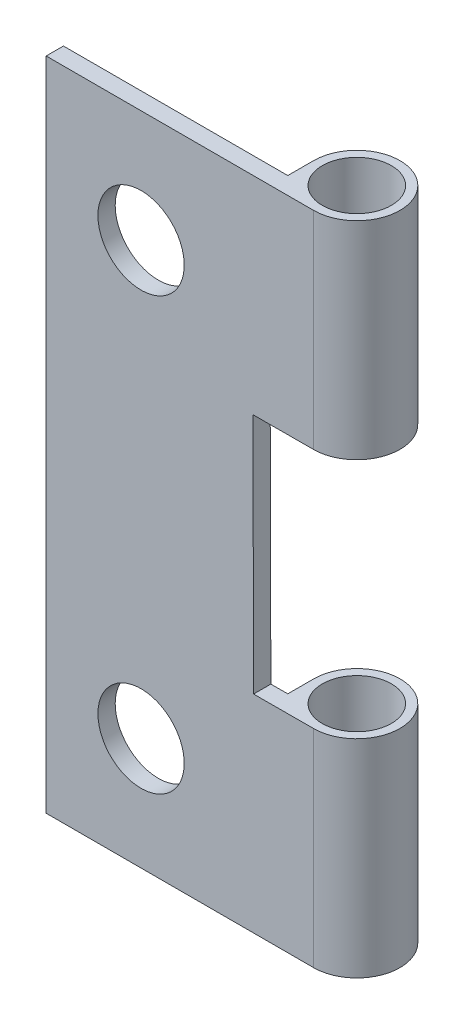
ISO-10303-21;
HEADER;
FILE_DESCRIPTION(('STEP AP214'),'2;1');
FILE_NAME('part.step','',(''),(''),'','','');
FILE_SCHEMA(('AUTOMOTIVE_DESIGN { 1 0 10303 214 1 1 1 1 }'));
ENDSEC;
DATA;
#1=APPLICATION_CONTEXT('core data for automotive mechanical design processes');
#2=APPLICATION_PROTOCOL_DEFINITION('international standard','automotive_design',2000,#1);
#3=PRODUCT_CONTEXT('',#1,'mechanical');
#4=PRODUCT('Part','Part','',(#3));
#5=PRODUCT_RELATED_PRODUCT_CATEGORY('part','',(#4));
#6=PRODUCT_DEFINITION_FORMATION('','',#4);
#7=PRODUCT_DEFINITION_CONTEXT('part definition',#1,'design');
#8=PRODUCT_DEFINITION('design','',#6,#7);
#9=PRODUCT_DEFINITION_SHAPE('','',#8);
#10=(LENGTH_UNIT() NAMED_UNIT(*) SI_UNIT(.MILLI.,.METRE.));
#11=(NAMED_UNIT(*) PLANE_ANGLE_UNIT() SI_UNIT($,.RADIAN.));
#12=(NAMED_UNIT(*) SI_UNIT($,.STERADIAN.) SOLID_ANGLE_UNIT());
#13=UNCERTAINTY_MEASURE_WITH_UNIT(LENGTH_MEASURE(1.E-05),#10,'distance_accuracy_value','');
#14=(GEOMETRIC_REPRESENTATION_CONTEXT(3) GLOBAL_UNCERTAINTY_ASSIGNED_CONTEXT((#13)) GLOBAL_UNIT_ASSIGNED_CONTEXT((#10,
#11,#12)) REPRESENTATION_CONTEXT('',''));
#15=CARTESIAN_POINT('',(0.,0.,0.));
#16=DIRECTION('',(0.,0.,1.));
#17=DIRECTION('',(1.,0.,0.));
#18=AXIS2_PLACEMENT_3D('',#15,#16,#17);
#19=CARTESIAN_POINT('',(6.5,-19.,1.));
#20=DIRECTION('',(-1.,0.,0.));
#21=DIRECTION('',(0.,0.,1.));
#22=AXIS2_PLACEMENT_3D('',#19,#20,#21);
#23=PLANE('',#22);
#24=DIRECTION('',(0.,0.,-1.));
#25=VECTOR('',#24,1.);
#26=CARTESIAN_POINT('',(6.5,6.99322023924465,1.));
#27=LINE('',#26,#25);
#28=CARTESIAN_POINT('',(6.5,6.99322023924465,0.));
#29=VERTEX_POINT('',#28);
#30=CARTESIAN_POINT('',(6.5,6.99322023924465,-1.5));
#31=VERTEX_POINT('',#30);
#32=EDGE_CURVE('E122',#29,#31,#27,.T.);
#33=ORIENTED_EDGE('',*,*,#32,.F.);
#34=DIRECTION('',(0.,1.,0.));
#35=VECTOR('',#34,1.);
#36=CARTESIAN_POINT('',(6.50000000000001,-19.,0.));
#37=LINE('',#36,#35);
#38=CARTESIAN_POINT('',(6.5,19.,0.));
#39=VERTEX_POINT('',#38);
#40=EDGE_CURVE('E100',#29,#39,#37,.T.);
#41=ORIENTED_EDGE('',*,*,#40,.T.);
#42=DIRECTION('',(0.,0.,1.));
#43=VECTOR('',#42,1.);
#44=CARTESIAN_POINT('',(6.5,19.,1.));
#45=LINE('',#44,#43);
#46=CARTESIAN_POINT('',(6.5,19.,-1.5));
#47=VERTEX_POINT('',#46);
#48=EDGE_CURVE('E81',#47,#39,#45,.T.);
#49=ORIENTED_EDGE('',*,*,#48,.F.);
#50=DIRECTION('',(0.,1.,0.));
#51=VECTOR('',#50,1.);
#52=CARTESIAN_POINT('',(6.5,-19.,-1.5));
#53=LINE('',#52,#51);
#54=EDGE_CURVE('E103',#31,#47,#53,.T.);
#55=ORIENTED_EDGE('',*,*,#54,.F.);
#56=EDGE_LOOP('',(#33,#41,#49,#55));
#57=FACE_BOUND('',#56,.T.);
#58=ADVANCED_FACE('F32',(#57),#23,.T.);
#59=CARTESIAN_POINT('',(9.,-19.,-1.5));
#60=DIRECTION('',(0.,1.,0.));
#61=DIRECTION('',(0.,0.,1.));
#62=AXIS2_PLACEMENT_3D('',#59,#60,#61);
#63=CYLINDRICAL_SURFACE('',#62,2.5);
#64=CARTESIAN_POINT('',(9.,7.00002593777009,-1.5));
#65=DIRECTION('',(-0.00272226932309199,0.999996294618001,0.));
#66=DIRECTION('',(0.999996294618001,0.00272226932309199,0.));
#67=AXIS2_PLACEMENT_3D('',#64,#65,#66);
#68=ELLIPSE('',#67,2.50000926348932,2.5);
#69=CARTESIAN_POINT('',(9.,7.00002593777009,1.));
#70=VERTEX_POINT('',#69);
#71=EDGE_CURVE('E117',#31,#70,#68,.F.);
#72=ORIENTED_EDGE('',*,*,#71,.F.);
#73=ORIENTED_EDGE('',*,*,#54,.T.);
#74=CARTESIAN_POINT('',(9.,19.,-1.5));
#75=DIRECTION('',(0.,1.,0.));
#76=DIRECTION('',(0.,0.,1.));
#77=AXIS2_PLACEMENT_3D('',#74,#75,#76);
#78=CIRCLE('',#77,2.5);
#79=CARTESIAN_POINT('',(9.,19.,1.));
#80=VERTEX_POINT('',#79);
#81=EDGE_CURVE('E149',#80,#47,#78,.T.);
#82=ORIENTED_EDGE('',*,*,#81,.F.);
#83=DIRECTION('',(0.,1.,0.));
#84=VECTOR('',#83,1.);
#85=CARTESIAN_POINT('',(9.,-19.,1.));
#86=LINE('',#85,#84);
#87=EDGE_CURVE('E152',#70,#80,#86,.T.);
#88=ORIENTED_EDGE('',*,*,#87,.F.);
#89=EDGE_LOOP('',(#72,#73,#82,#88));
#90=FACE_BOUND('',#89,.T.);
#91=ADVANCED_FACE('F259',(#90),#63,.T.);
#92=CARTESIAN_POINT('',(9.,-19.,-1.5));
#93=DIRECTION('',(0.,1.,0.));
#94=DIRECTION('',(0.,0.,1.));
#95=AXIS2_PLACEMENT_3D('',#92,#93,#94);
#96=CYLINDRICAL_SURFACE('',#95,2.);
#97=CARTESIAN_POINT('',(9.,7.00002593777009,-1.5));
#98=DIRECTION('',(-0.00272226932309199,0.999996294618001,0.));
#99=DIRECTION('',(0.999996294618001,0.00272226932309199,0.));
#100=AXIS2_PLACEMENT_3D('',#97,#98,#99);
#101=ELLIPSE('',#100,2.00000741079146,2.);
#102=CARTESIAN_POINT('',(11.,7.00547049659045,-1.5));
#103=VERTEX_POINT('',#102);
#104=EDGE_CURVE('E115',#103,#103,#101,.F.);
#105=ORIENTED_EDGE('',*,*,#104,.T.);
#106=EDGE_LOOP('',(#105));
#107=FACE_BOUND('',#106,.T.);
#108=CARTESIAN_POINT('',(9.,19.,-1.5));
#109=DIRECTION('',(0.,1.,0.));
#110=DIRECTION('',(0.,0.,1.));
#111=AXIS2_PLACEMENT_3D('',#108,#109,#110);
#112=CIRCLE('',#111,2.);
#113=CARTESIAN_POINT('',(9.,19.,0.499999999999999));
#114=VERTEX_POINT('',#113);
#115=EDGE_CURVE('E139',#114,#114,#112,.T.);
#116=ORIENTED_EDGE('',*,*,#115,.T.);
#117=EDGE_LOOP('',(#116));
#118=FACE_BOUND('',#117,.T.);
#119=ADVANCED_FACE('F263',(#107,#118),#96,.F.);
#120=CARTESIAN_POINT('',(-6.5,-19.,1.));
#121=DIRECTION('',(1.,0.,0.));
#122=DIRECTION('',(0.,1.,0.));
#123=AXIS2_PLACEMENT_3D('',#120,#121,#122);
#124=PLANE('',#123);
#125=DIRECTION('',(0.,-1.,0.));
#126=VECTOR('',#125,1.);
#127=CARTESIAN_POINT('',(-6.5,-19.,0.));
#128=LINE('',#127,#126);
#129=CARTESIAN_POINT('',(-6.50000000000001,19.,0.));
#130=VERTEX_POINT('',#129);
#131=CARTESIAN_POINT('',(-6.5,-19.,0.));
#132=VERTEX_POINT('',#131);
#133=EDGE_CURVE('E91',#130,#132,#128,.T.);
#134=ORIENTED_EDGE('',*,*,#133,.T.);
#135=DIRECTION('',(0.,0.,-1.));
#136=VECTOR('',#135,1.);
#137=CARTESIAN_POINT('',(-6.5,-19.,1.));
#138=LINE('',#137,#136);
#139=CARTESIAN_POINT('',(-6.5,-19.,1.));
#140=VERTEX_POINT('',#139);
#141=EDGE_CURVE('E40',#140,#132,#138,.T.);
#142=ORIENTED_EDGE('',*,*,#141,.F.);
#143=DIRECTION('',(0.,-1.,0.));
#144=VECTOR('',#143,1.);
#145=CARTESIAN_POINT('',(-6.5,-19.,1.));
#146=LINE('',#145,#144);
#147=CARTESIAN_POINT('',(-6.50000000000001,19.,1.));
#148=VERTEX_POINT('',#147);
#149=EDGE_CURVE('E85',#148,#140,#146,.T.);
#150=ORIENTED_EDGE('',*,*,#149,.F.);
#151=DIRECTION('',(0.,0.,-1.));
#152=VECTOR('',#151,1.);
#153=CARTESIAN_POINT('',(-6.50000000000001,19.,1.));
#154=LINE('',#153,#152);
#155=EDGE_CURVE('E77',#148,#130,#154,.T.);
#156=ORIENTED_EDGE('',*,*,#155,.T.);
#157=EDGE_LOOP('',(#134,#142,#150,#156));
#158=FACE_BOUND('',#157,.T.);
#159=ADVANCED_FACE('F34',(#158),#124,.F.);
#160=CARTESIAN_POINT('',(-6.5,-19.,1.));
#161=DIRECTION('',(0.,1.,0.));
#162=DIRECTION('',(0.,0.,1.));
#163=AXIS2_PLACEMENT_3D('',#160,#161,#162);
#164=PLANE('',#163);
#165=DIRECTION('',(1.,0.,0.));
#166=VECTOR('',#165,1.);
#167=CARTESIAN_POINT('',(-6.5,-19.,0.));
#168=LINE('',#167,#166);
#169=CARTESIAN_POINT('',(6.50000000000001,-19.,0.));
#170=VERTEX_POINT('',#169);
#171=EDGE_CURVE('E96',#132,#170,#168,.T.);
#172=ORIENTED_EDGE('',*,*,#171,.T.);
#173=DIRECTION('',(0.,0.,1.));
#174=VECTOR('',#173,1.);
#175=CARTESIAN_POINT('',(6.5,-19.,1.));
#176=LINE('',#175,#174);
#177=CARTESIAN_POINT('',(6.5,-19.,-1.5));
#178=VERTEX_POINT('',#177);
#179=EDGE_CURVE('E145',#178,#170,#176,.T.);
#180=ORIENTED_EDGE('',*,*,#179,.F.);
#181=CARTESIAN_POINT('',(9.,-19.,-1.5));
#182=DIRECTION('',(0.,1.,0.));
#183=DIRECTION('',(0.,0.,1.));
#184=AXIS2_PLACEMENT_3D('',#181,#182,#183);
#185=CIRCLE('',#184,2.5);
#186=CARTESIAN_POINT('',(9.,-19.,1.));
#187=VERTEX_POINT('',#186);
#188=EDGE_CURVE('E148',#187,#178,#185,.T.);
#189=ORIENTED_EDGE('',*,*,#188,.F.);
#190=DIRECTION('',(1.,0.,0.));
#191=VECTOR('',#190,1.);
#192=CARTESIAN_POINT('',(-6.5,-19.,1.));
#193=LINE('',#192,#191);
#194=EDGE_CURVE('E158',#140,#187,#193,.T.);
#195=ORIENTED_EDGE('',*,*,#194,.F.);
#196=ORIENTED_EDGE('',*,*,#141,.T.);
#197=EDGE_LOOP('',(#172,#180,#189,#195,#196));
#198=FACE_BOUND('',#197,.T.);
#199=CARTESIAN_POINT('',(9.,-19.,-1.5));
#200=DIRECTION('',(0.,1.,0.));
#201=DIRECTION('',(0.,0.,1.));
#202=AXIS2_PLACEMENT_3D('',#199,#200,#201);
#203=CIRCLE('',#202,2.);
#204=CARTESIAN_POINT('',(9.,-19.,0.499999999999999));
#205=VERTEX_POINT('',#204);
#206=EDGE_CURVE('E140',#205,#205,#203,.T.);
#207=ORIENTED_EDGE('',*,*,#206,.T.);
#208=EDGE_LOOP('',(#207));
#209=FACE_BOUND('',#208,.T.);
#210=ADVANCED_FACE('F172',(#198,#209),#164,.F.);
#211=CARTESIAN_POINT('',(-6.50000000000001,19.,1.));
#212=DIRECTION('',(0.,-1.,0.));
#213=DIRECTION('',(0.,0.,-1.));
#214=AXIS2_PLACEMENT_3D('',#211,#212,#213);
#215=PLANE('',#214);
#216=DIRECTION('',(-1.,0.,0.));
#217=VECTOR('',#216,1.);
#218=CARTESIAN_POINT('',(-6.50000000000001,19.,0.));
#219=LINE('',#218,#217);
#220=EDGE_CURVE('E73',#39,#130,#219,.T.);
#221=ORIENTED_EDGE('',*,*,#220,.T.);
#222=ORIENTED_EDGE('',*,*,#155,.F.);
#223=DIRECTION('',(-1.,0.,0.));
#224=VECTOR('',#223,1.);
#225=CARTESIAN_POINT('',(-6.50000000000001,19.,1.));
#226=LINE('',#225,#224);
#227=EDGE_CURVE('E56',#80,#148,#226,.T.);
#228=ORIENTED_EDGE('',*,*,#227,.F.);
#229=ORIENTED_EDGE('',*,*,#81,.T.);
#230=ORIENTED_EDGE('',*,*,#48,.T.);
#231=EDGE_LOOP('',(#221,#222,#228,#229,#230));
#232=FACE_BOUND('',#231,.T.);
#233=ORIENTED_EDGE('',*,*,#115,.F.);
#234=EDGE_LOOP('',(#233));
#235=FACE_BOUND('',#234,.T.);
#236=ADVANCED_FACE('F75',(#232,#235),#215,.F.);
#237=CARTESIAN_POINT('',(0.,0.,1.));
#238=DIRECTION('',(0.,0.,-1.));
#239=DIRECTION('',(-1.,0.,0.));
#240=AXIS2_PLACEMENT_3D('',#237,#238,#239);
#241=PLANE('',#240);
#242=CARTESIAN_POINT('',(-1.00000000000003,-12.5,1.));
#243=DIRECTION('',(0.,0.,-1.));
#244=DIRECTION('',(-1.,0.,0.));
#245=AXIS2_PLACEMENT_3D('',#242,#243,#244);
#246=CIRCLE('',#245,2.5);
#247=CARTESIAN_POINT('',(-3.50000000000003,-12.5,1.));
#248=VERTEX_POINT('',#247);
#249=EDGE_CURVE('E228',#248,#248,#246,.T.);
#250=ORIENTED_EDGE('',*,*,#249,.T.);
#251=EDGE_LOOP('',(#250));
#252=FACE_BOUND('',#251,.T.);
#253=CARTESIAN_POINT('',(-1.00000000000001,12.5,1.));
#254=DIRECTION('',(0.,0.,-1.));
#255=DIRECTION('',(-1.,0.,0.));
#256=AXIS2_PLACEMENT_3D('',#253,#254,#255);
#257=CIRCLE('',#256,2.5);
#258=CARTESIAN_POINT('',(-3.50000000000001,12.5,1.));
#259=VERTEX_POINT('',#258);
#260=EDGE_CURVE('E222',#259,#259,#257,.T.);
#261=ORIENTED_EDGE('',*,*,#260,.T.);
#262=EDGE_LOOP('',(#261));
#263=FACE_BOUND('',#262,.T.);
#264=DIRECTION('',(0.0027222693230923,-0.999996294618001,0.));
#265=VECTOR('',#264,1.);
#266=CARTESIAN_POINT('',(5.51906885409864,-7.00950200495684,1.));
#267=LINE('',#266,#265);
#268=CARTESIAN_POINT('',(5.48095708357535,6.99044611969518,1.));
#269=VERTEX_POINT('',#268);
#270=CARTESIAN_POINT('',(5.51906885409864,-7.00950200495684,1.));
#271=VERTEX_POINT('',#270);
#272=EDGE_CURVE('E220',#269,#271,#267,.T.);
#273=ORIENTED_EDGE('',*,*,#272,.F.);
#274=DIRECTION('',(-0.999996294618001,-0.00272226932309199,0.));
#275=VECTOR('',#274,1.);
#276=CARTESIAN_POINT('',(5.48095708357535,6.99044611969518,1.));
#277=LINE('',#276,#275);
#278=EDGE_CURVE('E211',#70,#269,#277,.T.);
#279=ORIENTED_EDGE('',*,*,#278,.F.);
#280=ORIENTED_EDGE('',*,*,#87,.T.);
#281=ORIENTED_EDGE('',*,*,#227,.T.);
#282=ORIENTED_EDGE('',*,*,#149,.T.);
#283=ORIENTED_EDGE('',*,*,#194,.T.);
#284=CARTESIAN_POINT('',(9.,-7.00002593777011,1.));
#285=VERTEX_POINT('',#284);
#286=EDGE_CURVE('E155',#187,#285,#86,.T.);
#287=ORIENTED_EDGE('',*,*,#286,.T.);
#288=DIRECTION('',(0.999996294618001,0.00272226932309199,0.));
#289=VECTOR('',#288,1.);
#290=CARTESIAN_POINT('',(5.51906885409864,-7.00950200495684,1.));
#291=LINE('',#290,#289);
#292=EDGE_CURVE('E47',#271,#285,#291,.T.);
#293=ORIENTED_EDGE('',*,*,#292,.F.);
#294=EDGE_LOOP('',(#273,#279,#280,#281,#282,#283,#287,#293));
#295=FACE_BOUND('',#294,.T.);
#296=ADVANCED_FACE('F163',(#252,#263,#295),#241,.F.);
#297=CARTESIAN_POINT('',(0.,0.,0.));
#298=DIRECTION('',(0.,0.,-1.));
#299=DIRECTION('',(-1.,0.,0.));
#300=AXIS2_PLACEMENT_3D('',#297,#298,#299);
#301=PLANE('',#300);
#302=CARTESIAN_POINT('',(-1.00000000000003,-12.5,0.));
#303=DIRECTION('',(0.,0.,-1.));
#304=DIRECTION('',(1.,0.,0.));
#305=AXIS2_PLACEMENT_3D('',#302,#303,#304);
#306=CIRCLE('',#305,2.5);
#307=CARTESIAN_POINT('',(1.49999999999998,-12.5,0.));
#308=VERTEX_POINT('',#307);
#309=EDGE_CURVE('E231',#308,#308,#306,.T.);
#310=ORIENTED_EDGE('',*,*,#309,.F.);
#311=EDGE_LOOP('',(#310));
#312=FACE_BOUND('',#311,.T.);
#313=CARTESIAN_POINT('',(-1.00000000000001,12.5,0.));
#314=DIRECTION('',(0.,0.,-1.));
#315=DIRECTION('',(-1.,0.,0.));
#316=AXIS2_PLACEMENT_3D('',#313,#314,#315);
#317=CIRCLE('',#316,2.5);
#318=CARTESIAN_POINT('',(-3.50000000000001,12.5,0.));
#319=VERTEX_POINT('',#318);
#320=EDGE_CURVE('E225',#319,#319,#317,.T.);
#321=ORIENTED_EDGE('',*,*,#320,.F.);
#322=EDGE_LOOP('',(#321));
#323=FACE_BOUND('',#322,.T.);
#324=DIRECTION('',(0.999996294618001,0.00272226932309199,0.));
#325=VECTOR('',#324,1.);
#326=CARTESIAN_POINT('',(-0.0189891885092369,6.97547372920161,0.));
#327=LINE('',#326,#325);
#328=CARTESIAN_POINT('',(5.48095708357535,6.99044611969518,0.));
#329=VERTEX_POINT('',#328);
#330=EDGE_CURVE('E136',#329,#29,#327,.T.);
#331=ORIENTED_EDGE('',*,*,#330,.F.);
#332=DIRECTION('',(-0.0027222693230923,0.999996294618001,0.));
#333=VECTOR('',#332,1.);
#334=CARTESIAN_POINT('',(5.49994627208459,0.014972390493578,0.));
#335=LINE('',#334,#333);
#336=CARTESIAN_POINT('',(5.51906885409864,-7.00950200495684,0.));
#337=VERTEX_POINT('',#336);
#338=EDGE_CURVE('E11',#337,#329,#335,.T.);
#339=ORIENTED_EDGE('',*,*,#338,.F.);
#340=DIRECTION('',(-0.999996294618001,-0.00272226932309199,0.));
#341=VECTOR('',#340,1.);
#342=CARTESIAN_POINT('',(0.019122582014051,-7.02447439545042,0.));
#343=LINE('',#342,#341);
#344=CARTESIAN_POINT('',(6.5,-7.00683163629555,0.));
#345=VERTEX_POINT('',#344);
#346=EDGE_CURVE('E118',#345,#337,#343,.T.);
#347=ORIENTED_EDGE('',*,*,#346,.F.);
#348=EDGE_CURVE('E86',#170,#345,#37,.T.);
#349=ORIENTED_EDGE('',*,*,#348,.F.);
#350=ORIENTED_EDGE('',*,*,#171,.F.);
#351=ORIENTED_EDGE('',*,*,#133,.F.);
#352=ORIENTED_EDGE('',*,*,#220,.F.);
#353=ORIENTED_EDGE('',*,*,#40,.F.);
#354=EDGE_LOOP('',(#331,#339,#347,#349,#350,#351,#352,#353));
#355=FACE_BOUND('',#354,.T.);
#356=ADVANCED_FACE('F94',(#312,#323,#355),#301,.T.);
#357=DIRECTION('',(0.,0.,1.));
#358=VECTOR('',#357,1.);
#359=CARTESIAN_POINT('',(6.5,-7.00683163629555,1.));
#360=LINE('',#359,#358);
#361=CARTESIAN_POINT('',(6.5,-7.00683163629555,-1.5));
#362=VERTEX_POINT('',#361);
#363=EDGE_CURVE('E125',#362,#345,#360,.T.);
#364=ORIENTED_EDGE('',*,*,#363,.F.);
#365=EDGE_CURVE('E98',#178,#362,#53,.T.);
#366=ORIENTED_EDGE('',*,*,#365,.F.);
#367=ORIENTED_EDGE('',*,*,#179,.T.);
#368=ORIENTED_EDGE('',*,*,#348,.T.);
#369=EDGE_LOOP('',(#364,#366,#367,#368));
#370=FACE_BOUND('',#369,.T.);
#371=ADVANCED_FACE('F178',(#370),#23,.T.);
#372=CARTESIAN_POINT('',(9.,-7.00002593777011,-1.5));
#373=DIRECTION('',(0.00272226932309199,-0.999996294618001,0.));
#374=DIRECTION('',(0.999996294618001,0.00272226932309199,0.));
#375=AXIS2_PLACEMENT_3D('',#372,#373,#374);
#376=ELLIPSE('',#375,2.50000926348932,2.5);
#377=EDGE_CURVE('E113',#285,#362,#376,.F.);
#378=ORIENTED_EDGE('',*,*,#377,.F.);
#379=ORIENTED_EDGE('',*,*,#286,.F.);
#380=ORIENTED_EDGE('',*,*,#188,.T.);
#381=ORIENTED_EDGE('',*,*,#365,.T.);
#382=EDGE_LOOP('',(#378,#379,#380,#381));
#383=FACE_BOUND('',#382,.T.);
#384=ADVANCED_FACE('F170',(#383),#63,.T.);
#385=CARTESIAN_POINT('',(9.,-7.00002593777011,-1.5));
#386=DIRECTION('',(0.00272226932309199,-0.999996294618001,0.));
#387=DIRECTION('',(0.999996294618001,0.00272226932309199,0.));
#388=AXIS2_PLACEMENT_3D('',#385,#386,#387);
#389=ELLIPSE('',#388,2.00000741079146,2.);
#390=CARTESIAN_POINT('',(11.,-6.99458137894975,-1.5));
#391=VERTEX_POINT('',#390);
#392=EDGE_CURVE('E111',#391,#391,#389,.F.);
#393=ORIENTED_EDGE('',*,*,#392,.T.);
#394=EDGE_LOOP('',(#393));
#395=FACE_BOUND('',#394,.T.);
#396=ORIENTED_EDGE('',*,*,#206,.F.);
#397=EDGE_LOOP('',(#396));
#398=FACE_BOUND('',#397,.T.);
#399=ADVANCED_FACE('F270',(#395,#398),#96,.F.);
#400=CARTESIAN_POINT('',(5.48095708357535,6.99044611969518,-9.));
#401=DIRECTION('',(-0.00272226932309199,0.999996294618001,0.));
#402=DIRECTION('',(-0.999996294618001,-0.00272226932309199,0.));
#403=AXIS2_PLACEMENT_3D('',#400,#401,#402);
#404=PLANE('',#403);
#405=ORIENTED_EDGE('',*,*,#330,.T.);
#406=ORIENTED_EDGE('',*,*,#32,.T.);
#407=ORIENTED_EDGE('',*,*,#71,.T.);
#408=ORIENTED_EDGE('',*,*,#278,.T.);
#409=DIRECTION('',(0.,0.,1.));
#410=VECTOR('',#409,1.);
#411=CARTESIAN_POINT('',(5.48095708357535,6.99044611969518,-9.));
#412=LINE('',#411,#410);
#413=EDGE_CURVE('E114',#329,#269,#412,.T.);
#414=ORIENTED_EDGE('',*,*,#413,.F.);
#415=EDGE_LOOP('',(#405,#406,#407,#408,#414));
#416=FACE_BOUND('',#415,.T.);
#417=ORIENTED_EDGE('',*,*,#104,.F.);
#418=EDGE_LOOP('',(#417));
#419=FACE_BOUND('',#418,.T.);
#420=ADVANCED_FACE('F205',(#416,#419),#404,.F.);
#421=CARTESIAN_POINT('',(5.51906885409864,-7.00950200495684,-9.));
#422=DIRECTION('',(0.00272226932309199,-0.999996294618001,0.));
#423=DIRECTION('',(0.999996294618001,0.00272226932309199,0.));
#424=AXIS2_PLACEMENT_3D('',#421,#422,#423);
#425=PLANE('',#424);
#426=ORIENTED_EDGE('',*,*,#346,.T.);
#427=DIRECTION('',(0.,0.,1.));
#428=VECTOR('',#427,1.);
#429=CARTESIAN_POINT('',(5.51906885409864,-7.00950200495684,-9.));
#430=LINE('',#429,#428);
#431=EDGE_CURVE('E214',#337,#271,#430,.T.);
#432=ORIENTED_EDGE('',*,*,#431,.T.);
#433=ORIENTED_EDGE('',*,*,#292,.T.);
#434=ORIENTED_EDGE('',*,*,#377,.T.);
#435=ORIENTED_EDGE('',*,*,#363,.T.);
#436=EDGE_LOOP('',(#426,#432,#433,#434,#435));
#437=FACE_BOUND('',#436,.T.);
#438=ORIENTED_EDGE('',*,*,#392,.F.);
#439=EDGE_LOOP('',(#438));
#440=FACE_BOUND('',#439,.T.);
#441=ADVANCED_FACE('F279',(#437,#440),#425,.F.);
#442=CARTESIAN_POINT('',(5.51906885409864,-7.00950200495684,-9.));
#443=DIRECTION('',(-0.999996294618001,-0.0027222693230923,0.));
#444=DIRECTION('',(0.0027222693230923,-0.999996294618001,0.));
#445=AXIS2_PLACEMENT_3D('',#442,#443,#444);
#446=PLANE('',#445);
#447=ORIENTED_EDGE('',*,*,#338,.T.);
#448=ORIENTED_EDGE('',*,*,#413,.T.);
#449=ORIENTED_EDGE('',*,*,#272,.T.);
#450=ORIENTED_EDGE('',*,*,#431,.F.);
#451=EDGE_LOOP('',(#447,#448,#449,#450));
#452=FACE_BOUND('',#451,.T.);
#453=ADVANCED_FACE('F246',(#452),#446,.F.);
#454=CARTESIAN_POINT('',(-1.00000000000001,12.5,2.));
#455=DIRECTION('',(0.,0.,-1.));
#456=DIRECTION('',(-1.,0.,0.));
#457=AXIS2_PLACEMENT_3D('',#454,#455,#456);
#458=CYLINDRICAL_SURFACE('',#457,2.5);
#459=ORIENTED_EDGE('',*,*,#320,.T.);
#460=EDGE_LOOP('',(#459));
#461=FACE_BOUND('',#460,.T.);
#462=ORIENTED_EDGE('',*,*,#260,.F.);
#463=EDGE_LOOP('',(#462));
#464=FACE_BOUND('',#463,.T.);
#465=ADVANCED_FACE('F243',(#461,#464),#458,.F.);
#466=CARTESIAN_POINT('',(-1.00000000000003,-12.5,2.));
#467=DIRECTION('',(0.,0.,-1.));
#468=DIRECTION('',(-1.,0.,0.));
#469=AXIS2_PLACEMENT_3D('',#466,#467,#468);
#470=CYLINDRICAL_SURFACE('',#469,2.5);
#471=ORIENTED_EDGE('',*,*,#309,.T.);
#472=EDGE_LOOP('',(#471));
#473=FACE_BOUND('',#472,.T.);
#474=ORIENTED_EDGE('',*,*,#249,.F.);
#475=EDGE_LOOP('',(#474));
#476=FACE_BOUND('',#475,.T.);
#477=ADVANCED_FACE('F235',(#473,#476),#470,.F.);
#478=CLOSED_SHELL('',(#58,#91,#119,#159,#210,#236,#296,#356,#371,#384,#399,#420,#441,#453,#465,#477));
#479=MANIFOLD_SOLID_BREP('B2',#478);
#480=ADVANCED_BREP_SHAPE_REPRESENTATION('',(#18,#479),#14);
#481=SHAPE_DEFINITION_REPRESENTATION(#9,#480);
ENDSEC;
END-ISO-10303-21;
